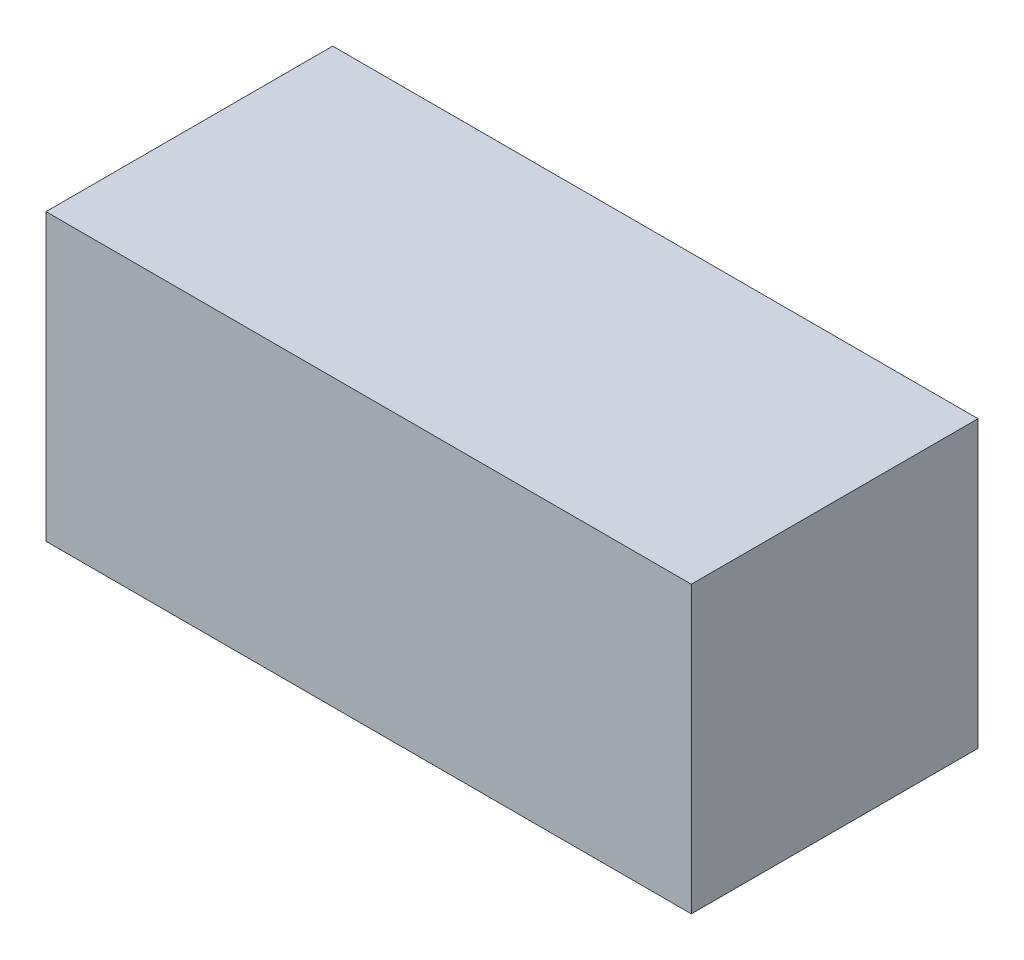
ISO-10303-21;
HEADER;
FILE_DESCRIPTION(('STEP AP214'),'2;1');
FILE_NAME('part.step','',(''),(''),'','','');
FILE_SCHEMA(('AUTOMOTIVE_DESIGN { 1 0 10303 214 1 1 1 1 }'));
ENDSEC;
DATA;
#1=APPLICATION_CONTEXT('core data for automotive mechanical design processes');
#2=APPLICATION_PROTOCOL_DEFINITION('international standard','automotive_design',2000,#1);
#3=PRODUCT_CONTEXT('',#1,'mechanical');
#4=PRODUCT('Part','Part','',(#3));
#5=PRODUCT_RELATED_PRODUCT_CATEGORY('part','',(#4));
#6=PRODUCT_DEFINITION_FORMATION('','',#4);
#7=PRODUCT_DEFINITION_CONTEXT('part definition',#1,'design');
#8=PRODUCT_DEFINITION('design','',#6,#7);
#9=PRODUCT_DEFINITION_SHAPE('','',#8);
#10=(LENGTH_UNIT() NAMED_UNIT(*) SI_UNIT(.MILLI.,.METRE.));
#11=(NAMED_UNIT(*) PLANE_ANGLE_UNIT() SI_UNIT($,.RADIAN.));
#12=(NAMED_UNIT(*) SI_UNIT($,.STERADIAN.) SOLID_ANGLE_UNIT());
#13=UNCERTAINTY_MEASURE_WITH_UNIT(LENGTH_MEASURE(1.E-05),#10,'distance_accuracy_value','');
#14=(GEOMETRIC_REPRESENTATION_CONTEXT(3) GLOBAL_UNCERTAINTY_ASSIGNED_CONTEXT((#13)) GLOBAL_UNIT_ASSIGNED_CONTEXT((#10,
#11,#12)) REPRESENTATION_CONTEXT('',''));
#15=CARTESIAN_POINT('',(0.,0.,0.));
#16=DIRECTION('',(0.,0.,1.));
#17=DIRECTION('',(1.,0.,0.));
#18=AXIS2_PLACEMENT_3D('',#15,#16,#17);
#19=CARTESIAN_POINT('',(1.38745,-2.98755,0.));
#20=DIRECTION('',(1.,0.,0.));
#21=DIRECTION('',(0.,0.,1.));
#22=AXIS2_PLACEMENT_3D('',#19,#20,#21);
#23=PLANE('',#22);
#24=DIRECTION('',(0.,1.,0.));
#25=VECTOR('',#24,1.);
#26=CARTESIAN_POINT('',(1.38745,-2.98755,0.1));
#27=LINE('',#26,#25);
#28=CARTESIAN_POINT('',(1.38745,-2.98755,0.1));
#29=VERTEX_POINT('',#28);
#30=CARTESIAN_POINT('',(1.38745,-2.88795,0.1));
#31=VERTEX_POINT('',#30);
#32=EDGE_CURVE('E11',#29,#31,#27,.T.);
#33=ORIENTED_EDGE('',*,*,#32,.T.);
#34=DIRECTION('',(0.,0.,1.));
#35=VECTOR('',#34,1.);
#36=CARTESIAN_POINT('',(1.38745,-2.88795,0.));
#37=LINE('',#36,#35);
#38=CARTESIAN_POINT('',(1.38745,-2.88795,0.));
#39=VERTEX_POINT('',#38);
#40=EDGE_CURVE('E24',#39,#31,#37,.T.);
#41=ORIENTED_EDGE('',*,*,#40,.F.);
#42=DIRECTION('',(0.,1.,0.));
#43=VECTOR('',#42,1.);
#44=CARTESIAN_POINT('',(1.38745,-2.98755,0.));
#45=LINE('',#44,#43);
#46=CARTESIAN_POINT('',(1.38745,-2.98755,0.));
#47=VERTEX_POINT('',#46);
#48=EDGE_CURVE('E86',#47,#39,#45,.T.);
#49=ORIENTED_EDGE('',*,*,#48,.F.);
#50=DIRECTION('',(0.,0.,1.));
#51=VECTOR('',#50,1.);
#52=CARTESIAN_POINT('',(1.38745,-2.98755,0.));
#53=LINE('',#52,#51);
#54=EDGE_CURVE('E36',#47,#29,#53,.T.);
#55=ORIENTED_EDGE('',*,*,#54,.T.);
#56=EDGE_LOOP('',(#33,#41,#49,#55));
#57=FACE_BOUND('',#56,.T.);
#58=ADVANCED_FACE('F17',(#57),#23,.F.);
#59=CARTESIAN_POINT('',(1.61255,-2.98755,0.));
#60=DIRECTION('',(1.,0.,0.));
#61=DIRECTION('',(0.,0.,1.));
#62=AXIS2_PLACEMENT_3D('',#59,#60,#61);
#63=PLANE('',#62);
#64=DIRECTION('',(0.,0.,1.));
#65=VECTOR('',#64,1.);
#66=CARTESIAN_POINT('',(1.61255,-2.98755,0.));
#67=LINE('',#66,#65);
#68=CARTESIAN_POINT('',(1.61255,-2.98755,0.));
#69=VERTEX_POINT('',#68);
#70=CARTESIAN_POINT('',(1.61255,-2.98755,0.1));
#71=VERTEX_POINT('',#70);
#72=EDGE_CURVE('E83',#69,#71,#67,.T.);
#73=ORIENTED_EDGE('',*,*,#72,.F.);
#74=DIRECTION('',(0.,1.,0.));
#75=VECTOR('',#74,1.);
#76=CARTESIAN_POINT('',(1.61255,-2.98755,0.));
#77=LINE('',#76,#75);
#78=CARTESIAN_POINT('',(1.61255,-2.88795,0.));
#79=VERTEX_POINT('',#78);
#80=EDGE_CURVE('E63',#69,#79,#77,.T.);
#81=ORIENTED_EDGE('',*,*,#80,.T.);
#82=DIRECTION('',(0.,0.,1.));
#83=VECTOR('',#82,1.);
#84=CARTESIAN_POINT('',(1.61255,-2.88795,0.));
#85=LINE('',#84,#83);
#86=CARTESIAN_POINT('',(1.61255,-2.88795,0.1));
#87=VERTEX_POINT('',#86);
#88=EDGE_CURVE('E57',#79,#87,#85,.T.);
#89=ORIENTED_EDGE('',*,*,#88,.T.);
#90=DIRECTION('',(0.,1.,0.));
#91=VECTOR('',#90,1.);
#92=CARTESIAN_POINT('',(1.61255,-2.98755,0.1));
#93=LINE('',#92,#91);
#94=EDGE_CURVE('E60',#71,#87,#93,.T.);
#95=ORIENTED_EDGE('',*,*,#94,.F.);
#96=EDGE_LOOP('',(#73,#81,#89,#95));
#97=FACE_BOUND('',#96,.T.);
#98=ADVANCED_FACE('F59',(#97),#63,.T.);
#99=CARTESIAN_POINT('',(1.38745,-2.98755,0.));
#100=DIRECTION('',(0.,1.,0.));
#101=DIRECTION('',(0.,0.,1.));
#102=AXIS2_PLACEMENT_3D('',#99,#100,#101);
#103=PLANE('',#102);
#104=ORIENTED_EDGE('',*,*,#72,.T.);
#105=DIRECTION('',(1.,0.,0.));
#106=VECTOR('',#105,1.);
#107=CARTESIAN_POINT('',(1.38745,-2.98755,0.1));
#108=LINE('',#107,#106);
#109=EDGE_CURVE('E71',#29,#71,#108,.T.);
#110=ORIENTED_EDGE('',*,*,#109,.F.);
#111=ORIENTED_EDGE('',*,*,#54,.F.);
#112=DIRECTION('',(1.,0.,0.));
#113=VECTOR('',#112,1.);
#114=CARTESIAN_POINT('',(1.38745,-2.98755,0.));
#115=LINE('',#114,#113);
#116=EDGE_CURVE('E76',#47,#69,#115,.T.);
#117=ORIENTED_EDGE('',*,*,#116,.T.);
#118=EDGE_LOOP('',(#104,#110,#111,#117));
#119=FACE_BOUND('',#118,.T.);
#120=ADVANCED_FACE('F91',(#119),#103,.F.);
#121=CARTESIAN_POINT('',(1.38745,-2.88795,0.));
#122=DIRECTION('',(0.,1.,0.));
#123=DIRECTION('',(0.,0.,1.));
#124=AXIS2_PLACEMENT_3D('',#121,#122,#123);
#125=PLANE('',#124);
#126=DIRECTION('',(1.,0.,0.));
#127=VECTOR('',#126,1.);
#128=CARTESIAN_POINT('',(1.38745,-2.88795,0.));
#129=LINE('',#128,#127);
#130=EDGE_CURVE('E74',#39,#79,#129,.T.);
#131=ORIENTED_EDGE('',*,*,#130,.F.);
#132=ORIENTED_EDGE('',*,*,#40,.T.);
#133=DIRECTION('',(1.,0.,0.));
#134=VECTOR('',#133,1.);
#135=CARTESIAN_POINT('',(1.38745,-2.88795,0.1));
#136=LINE('',#135,#134);
#137=EDGE_CURVE('E69',#31,#87,#136,.T.);
#138=ORIENTED_EDGE('',*,*,#137,.T.);
#139=ORIENTED_EDGE('',*,*,#88,.F.);
#140=EDGE_LOOP('',(#131,#132,#138,#139));
#141=FACE_BOUND('',#140,.T.);
#142=ADVANCED_FACE('F73',(#141),#125,.T.);
#143=CARTESIAN_POINT('',(1.38745,-2.98755,0.));
#144=DIRECTION('',(0.,0.,1.));
#145=DIRECTION('',(1.,0.,0.));
#146=AXIS2_PLACEMENT_3D('',#143,#144,#145);
#147=PLANE('',#146);
#148=ORIENTED_EDGE('',*,*,#130,.T.);
#149=ORIENTED_EDGE('',*,*,#80,.F.);
#150=ORIENTED_EDGE('',*,*,#116,.F.);
#151=ORIENTED_EDGE('',*,*,#48,.T.);
#152=EDGE_LOOP('',(#148,#149,#150,#151));
#153=FACE_BOUND('',#152,.T.);
#154=ADVANCED_FACE('F89',(#153),#147,.F.);
#155=CARTESIAN_POINT('',(1.38745,-2.98755,0.1));
#156=DIRECTION('',(0.,0.,1.));
#157=DIRECTION('',(1.,0.,0.));
#158=AXIS2_PLACEMENT_3D('',#155,#156,#157);
#159=PLANE('',#158);
#160=ORIENTED_EDGE('',*,*,#32,.F.);
#161=ORIENTED_EDGE('',*,*,#109,.T.);
#162=ORIENTED_EDGE('',*,*,#94,.T.);
#163=ORIENTED_EDGE('',*,*,#137,.F.);
#164=EDGE_LOOP('',(#160,#161,#162,#163));
#165=FACE_BOUND('',#164,.T.);
#166=ADVANCED_FACE('F68',(#165),#159,.T.);
#167=CLOSED_SHELL('',(#58,#98,#120,#142,#154,#166));
#168=MANIFOLD_SOLID_BREP('B1',#167);
#169=ADVANCED_BREP_SHAPE_REPRESENTATION('',(#18,#168),#14);
#170=SHAPE_DEFINITION_REPRESENTATION(#9,#169);
ENDSEC;
END-ISO-10303-21;
